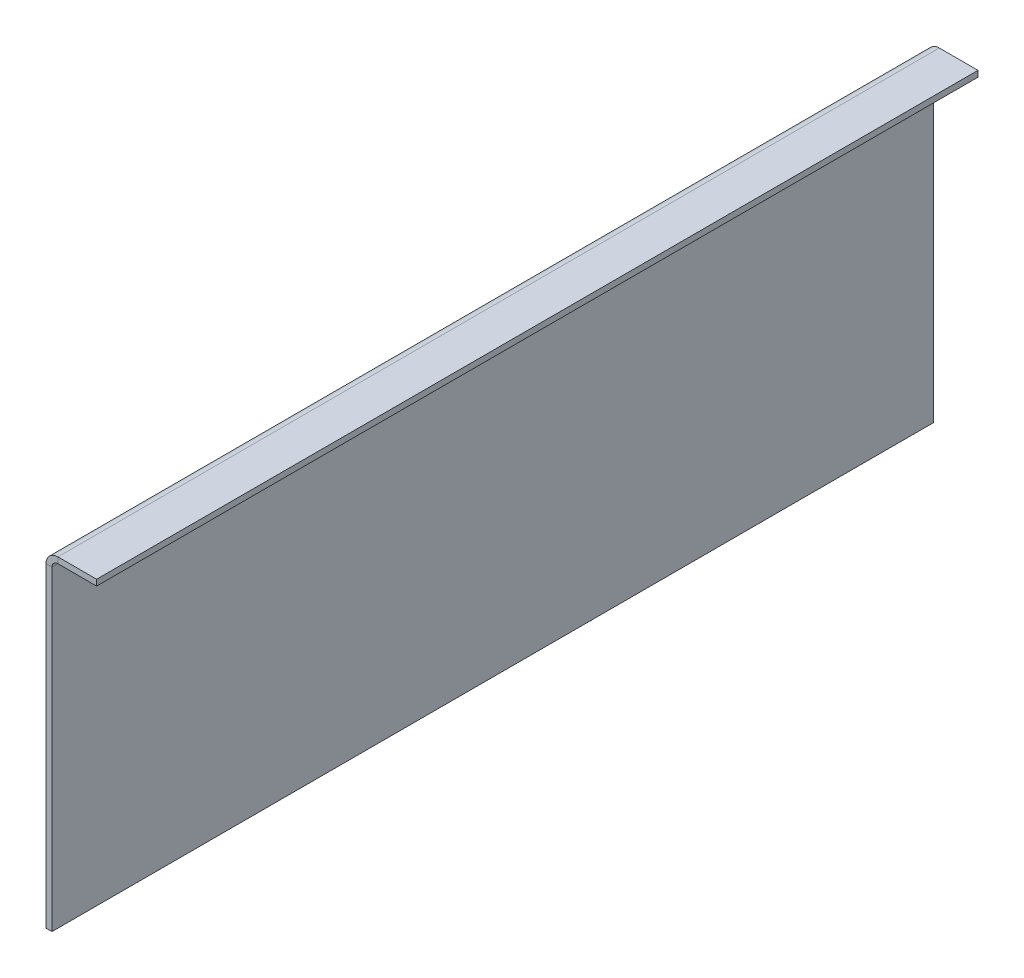
ISO-10303-21;
HEADER;
FILE_DESCRIPTION(('STEP AP214'),'2;1');
FILE_NAME('part.step','',(''),(''),'','','');
FILE_SCHEMA(('AUTOMOTIVE_DESIGN { 1 0 10303 214 1 1 1 1 }'));
ENDSEC;
DATA;
#1=APPLICATION_CONTEXT('core data for automotive mechanical design processes');
#2=APPLICATION_PROTOCOL_DEFINITION('international standard','automotive_design',2000,#1);
#3=PRODUCT_CONTEXT('',#1,'mechanical');
#4=PRODUCT('Part','Part','',(#3));
#5=PRODUCT_RELATED_PRODUCT_CATEGORY('part','',(#4));
#6=PRODUCT_DEFINITION_FORMATION('','',#4);
#7=PRODUCT_DEFINITION_CONTEXT('part definition',#1,'design');
#8=PRODUCT_DEFINITION('design','',#6,#7);
#9=PRODUCT_DEFINITION_SHAPE('','',#8);
#10=(LENGTH_UNIT() NAMED_UNIT(*) SI_UNIT(.MILLI.,.METRE.));
#11=(NAMED_UNIT(*) PLANE_ANGLE_UNIT() SI_UNIT($,.RADIAN.));
#12=(NAMED_UNIT(*) SI_UNIT($,.STERADIAN.) SOLID_ANGLE_UNIT());
#13=UNCERTAINTY_MEASURE_WITH_UNIT(LENGTH_MEASURE(1.E-05),#10,'distance_accuracy_value','');
#14=(GEOMETRIC_REPRESENTATION_CONTEXT(3) GLOBAL_UNCERTAINTY_ASSIGNED_CONTEXT((#13)) GLOBAL_UNIT_ASSIGNED_CONTEXT((#10,
#11,#12)) REPRESENTATION_CONTEXT('',''));
#15=CARTESIAN_POINT('',(0.,0.,0.));
#16=DIRECTION('',(0.,0.,1.));
#17=DIRECTION('',(1.,0.,0.));
#18=AXIS2_PLACEMENT_3D('',#15,#16,#17);
#19=CARTESIAN_POINT('',(17.,108.,-148.));
#20=DIRECTION('',(0.,0.,1.));
#21=DIRECTION('',(1.,0.,0.));
#22=AXIS2_PLACEMENT_3D('',#19,#20,#21);
#23=PLANE('',#22);
#24=DIRECTION('',(0.,-1.,0.));
#25=VECTOR('',#24,1.);
#26=CARTESIAN_POINT('',(3.99999999999999,108.,-148.));
#27=LINE('',#26,#25);
#28=CARTESIAN_POINT('',(3.99999999999999,110.,-148.));
#29=VERTEX_POINT('',#28);
#30=CARTESIAN_POINT('',(3.99999999999999,108.,-148.));
#31=VERTEX_POINT('',#30);
#32=EDGE_CURVE('E11',#29,#31,#27,.T.);
#33=ORIENTED_EDGE('',*,*,#32,.F.);
#34=DIRECTION('',(1.,0.,0.));
#35=VECTOR('',#34,1.);
#36=CARTESIAN_POINT('',(17.,110.,-148.));
#37=LINE('',#36,#35);
#38=CARTESIAN_POINT('',(17.,110.,-148.));
#39=VERTEX_POINT('',#38);
#40=EDGE_CURVE('E93',#29,#39,#37,.T.);
#41=ORIENTED_EDGE('',*,*,#40,.T.);
#42=DIRECTION('',(0.,-1.,0.));
#43=VECTOR('',#42,1.);
#44=CARTESIAN_POINT('',(17.,108.,-148.));
#45=LINE('',#44,#43);
#46=CARTESIAN_POINT('',(17.,108.,-148.));
#47=VERTEX_POINT('',#46);
#48=EDGE_CURVE('E53',#39,#47,#45,.T.);
#49=ORIENTED_EDGE('',*,*,#48,.T.);
#50=DIRECTION('',(1.,0.,0.));
#51=VECTOR('',#50,1.);
#52=CARTESIAN_POINT('',(17.,108.,-148.));
#53=LINE('',#52,#51);
#54=EDGE_CURVE('E96',#31,#47,#53,.T.);
#55=ORIENTED_EDGE('',*,*,#54,.F.);
#56=EDGE_LOOP('',(#33,#41,#49,#55));
#57=FACE_BOUND('',#56,.T.);
#58=ADVANCED_FACE('F43',(#57),#23,.F.);
#59=CARTESIAN_POINT('',(17.,108.,148.));
#60=DIRECTION('',(1.,0.,0.));
#61=DIRECTION('',(0.,0.,-1.));
#62=AXIS2_PLACEMENT_3D('',#59,#60,#61);
#63=PLANE('',#62);
#64=ORIENTED_EDGE('',*,*,#48,.F.);
#65=DIRECTION('',(0.,0.,1.));
#66=VECTOR('',#65,1.);
#67=CARTESIAN_POINT('',(17.,110.,148.));
#68=LINE('',#67,#66);
#69=CARTESIAN_POINT('',(17.,110.,148.));
#70=VERTEX_POINT('',#69);
#71=EDGE_CURVE('E121',#70,#39,#68,.F.);
#72=ORIENTED_EDGE('',*,*,#71,.F.);
#73=DIRECTION('',(0.,-1.,0.));
#74=VECTOR('',#73,1.);
#75=CARTESIAN_POINT('',(17.,108.,148.));
#76=LINE('',#75,#74);
#77=CARTESIAN_POINT('',(17.,108.,148.));
#78=VERTEX_POINT('',#77);
#79=EDGE_CURVE('E139',#70,#78,#76,.T.);
#80=ORIENTED_EDGE('',*,*,#79,.T.);
#81=DIRECTION('',(0.,0.,-1.));
#82=VECTOR('',#81,1.);
#83=CARTESIAN_POINT('',(17.,108.,148.));
#84=LINE('',#83,#82);
#85=EDGE_CURVE('E150',#78,#47,#84,.T.);
#86=ORIENTED_EDGE('',*,*,#85,.T.);
#87=EDGE_LOOP('',(#64,#72,#80,#86));
#88=FACE_BOUND('',#87,.T.);
#89=ADVANCED_FACE('F156',(#88),#63,.T.);
#90=CARTESIAN_POINT('',(17.,108.,148.));
#91=DIRECTION('',(0.,0.,1.));
#92=DIRECTION('',(1.,0.,0.));
#93=AXIS2_PLACEMENT_3D('',#90,#91,#92);
#94=PLANE('',#93);
#95=ORIENTED_EDGE('',*,*,#79,.F.);
#96=DIRECTION('',(1.,0.,0.));
#97=VECTOR('',#96,1.);
#98=CARTESIAN_POINT('',(17.,110.,148.));
#99=LINE('',#98,#97);
#100=CARTESIAN_POINT('',(3.99999999999999,110.,148.));
#101=VERTEX_POINT('',#100);
#102=EDGE_CURVE('E181',#101,#70,#99,.T.);
#103=ORIENTED_EDGE('',*,*,#102,.F.);
#104=DIRECTION('',(0.,-1.,0.));
#105=VECTOR('',#104,1.);
#106=CARTESIAN_POINT('',(3.99999999999999,108.,148.));
#107=LINE('',#106,#105);
#108=CARTESIAN_POINT('',(3.99999999999999,108.,148.));
#109=VERTEX_POINT('',#108);
#110=EDGE_CURVE('E136',#101,#109,#107,.T.);
#111=ORIENTED_EDGE('',*,*,#110,.T.);
#112=DIRECTION('',(1.,0.,0.));
#113=VECTOR('',#112,1.);
#114=CARTESIAN_POINT('',(17.,108.,148.));
#115=LINE('',#114,#113);
#116=EDGE_CURVE('E157',#109,#78,#115,.T.);
#117=ORIENTED_EDGE('',*,*,#116,.T.);
#118=EDGE_LOOP('',(#95,#103,#111,#117));
#119=FACE_BOUND('',#118,.T.);
#120=ADVANCED_FACE('F187',(#119),#94,.T.);
#121=CARTESIAN_POINT('',(3.99999999999999,106.,148.));
#122=DIRECTION('',(0.,0.,1.));
#123=DIRECTION('',(1.,0.,0.));
#124=AXIS2_PLACEMENT_3D('',#121,#122,#123);
#125=PLANE('',#124);
#126=ORIENTED_EDGE('',*,*,#110,.F.);
#127=CARTESIAN_POINT('',(3.99999999999999,106.,148.));
#128=DIRECTION('',(0.,0.,1.));
#129=DIRECTION('',(1.,0.,0.));
#130=AXIS2_PLACEMENT_3D('',#127,#128,#129);
#131=CIRCLE('',#130,4.);
#132=CARTESIAN_POINT('',(0.,106.,148.));
#133=VERTEX_POINT('',#132);
#134=EDGE_CURVE('E111',#101,#133,#131,.T.);
#135=ORIENTED_EDGE('',*,*,#134,.T.);
#136=DIRECTION('',(1.,0.,0.));
#137=VECTOR('',#136,1.);
#138=CARTESIAN_POINT('',(1.99999999999999,106.,148.));
#139=LINE('',#138,#137);
#140=CARTESIAN_POINT('',(1.99999999999999,106.,148.));
#141=VERTEX_POINT('',#140);
#142=EDGE_CURVE('E61',#133,#141,#139,.T.);
#143=ORIENTED_EDGE('',*,*,#142,.T.);
#144=CARTESIAN_POINT('',(3.99999999999999,106.,148.));
#145=DIRECTION('',(0.,0.,-1.));
#146=DIRECTION('',(-1.,0.,0.));
#147=AXIS2_PLACEMENT_3D('',#144,#145,#146);
#148=CIRCLE('',#147,2.);
#149=EDGE_CURVE('E154',#109,#141,#148,.F.);
#150=ORIENTED_EDGE('',*,*,#149,.F.);
#151=EDGE_LOOP('',(#126,#135,#143,#150));
#152=FACE_BOUND('',#151,.T.);
#153=ADVANCED_FACE('F190',(#152),#125,.T.);
#154=CARTESIAN_POINT('',(1.99999999999999,108.,148.));
#155=DIRECTION('',(0.,0.,1.));
#156=DIRECTION('',(0.,1.,0.));
#157=AXIS2_PLACEMENT_3D('',#154,#155,#156);
#158=PLANE('',#157);
#159=ORIENTED_EDGE('',*,*,#142,.F.);
#160=DIRECTION('',(0.,-1.,0.));
#161=VECTOR('',#160,1.);
#162=CARTESIAN_POINT('',(0.,108.,148.));
#163=LINE('',#162,#161);
#164=CARTESIAN_POINT('',(0.,0.,148.));
#165=VERTEX_POINT('',#164);
#166=EDGE_CURVE('E180',#165,#133,#163,.F.);
#167=ORIENTED_EDGE('',*,*,#166,.F.);
#168=DIRECTION('',(1.,0.,0.));
#169=VECTOR('',#168,1.);
#170=CARTESIAN_POINT('',(2.,0.,148.));
#171=LINE('',#170,#169);
#172=CARTESIAN_POINT('',(2.,0.,148.));
#173=VERTEX_POINT('',#172);
#174=EDGE_CURVE('E132',#165,#173,#171,.T.);
#175=ORIENTED_EDGE('',*,*,#174,.T.);
#176=DIRECTION('',(0.,1.,0.));
#177=VECTOR('',#176,1.);
#178=CARTESIAN_POINT('',(1.99999999999999,108.,148.));
#179=LINE('',#178,#177);
#180=EDGE_CURVE('E164',#173,#141,#179,.T.);
#181=ORIENTED_EDGE('',*,*,#180,.T.);
#182=EDGE_LOOP('',(#159,#167,#175,#181));
#183=FACE_BOUND('',#182,.T.);
#184=ADVANCED_FACE('F201',(#183),#158,.T.);
#185=CARTESIAN_POINT('',(2.,0.,148.));
#186=DIRECTION('',(0.,1.,0.));
#187=DIRECTION('',(0.,0.,-1.));
#188=AXIS2_PLACEMENT_3D('',#185,#186,#187);
#189=PLANE('',#188);
#190=ORIENTED_EDGE('',*,*,#174,.F.);
#191=DIRECTION('',(0.,0.,1.));
#192=VECTOR('',#191,1.);
#193=CARTESIAN_POINT('',(0.,0.,148.));
#194=LINE('',#193,#192);
#195=CARTESIAN_POINT('',(0.,0.,-148.));
#196=VERTEX_POINT('',#195);
#197=EDGE_CURVE('E116',#165,#196,#194,.F.);
#198=ORIENTED_EDGE('',*,*,#197,.T.);
#199=DIRECTION('',(1.,0.,0.));
#200=VECTOR('',#199,1.);
#201=CARTESIAN_POINT('',(2.,0.,-148.));
#202=LINE('',#201,#200);
#203=CARTESIAN_POINT('',(2.,0.,-148.));
#204=VERTEX_POINT('',#203);
#205=EDGE_CURVE('E129',#196,#204,#202,.T.);
#206=ORIENTED_EDGE('',*,*,#205,.T.);
#207=DIRECTION('',(0.,0.,-1.));
#208=VECTOR('',#207,1.);
#209=CARTESIAN_POINT('',(2.,0.,148.));
#210=LINE('',#209,#208);
#211=EDGE_CURVE('E167',#173,#204,#210,.T.);
#212=ORIENTED_EDGE('',*,*,#211,.F.);
#213=EDGE_LOOP('',(#190,#198,#206,#212));
#214=FACE_BOUND('',#213,.T.);
#215=ADVANCED_FACE('F207',(#214),#189,.F.);
#216=CARTESIAN_POINT('',(1.99999999999999,108.,-148.));
#217=DIRECTION('',(0.,0.,1.));
#218=DIRECTION('',(0.,1.,0.));
#219=AXIS2_PLACEMENT_3D('',#216,#217,#218);
#220=PLANE('',#219);
#221=ORIENTED_EDGE('',*,*,#205,.F.);
#222=DIRECTION('',(0.,-1.,0.));
#223=VECTOR('',#222,1.);
#224=CARTESIAN_POINT('',(0.,108.,-148.));
#225=LINE('',#224,#223);
#226=CARTESIAN_POINT('',(0.,106.,-148.));
#227=VERTEX_POINT('',#226);
#228=EDGE_CURVE('E178',#196,#227,#225,.F.);
#229=ORIENTED_EDGE('',*,*,#228,.T.);
#230=DIRECTION('',(1.,0.,0.));
#231=VECTOR('',#230,1.);
#232=CARTESIAN_POINT('',(1.99999999999999,106.,-148.));
#233=LINE('',#232,#231);
#234=CARTESIAN_POINT('',(1.99999999999999,106.,-148.));
#235=VERTEX_POINT('',#234);
#236=EDGE_CURVE('E47',#227,#235,#233,.T.);
#237=ORIENTED_EDGE('',*,*,#236,.T.);
#238=DIRECTION('',(0.,1.,0.));
#239=VECTOR('',#238,1.);
#240=CARTESIAN_POINT('',(1.99999999999999,108.,-148.));
#241=LINE('',#240,#239);
#242=EDGE_CURVE('E159',#204,#235,#241,.T.);
#243=ORIENTED_EDGE('',*,*,#242,.F.);
#244=EDGE_LOOP('',(#221,#229,#237,#243));
#245=FACE_BOUND('',#244,.T.);
#246=ADVANCED_FACE('F211',(#245),#220,.F.);
#247=CARTESIAN_POINT('',(3.99999999999999,106.,-148.));
#248=DIRECTION('',(0.,0.,-1.));
#249=DIRECTION('',(-1.,0.,0.));
#250=AXIS2_PLACEMENT_3D('',#247,#248,#249);
#251=PLANE('',#250);
#252=CARTESIAN_POINT('',(3.99999999999999,106.,-148.));
#253=DIRECTION('',(0.,0.,1.));
#254=DIRECTION('',(1.,0.,0.));
#255=AXIS2_PLACEMENT_3D('',#252,#253,#254);
#256=CIRCLE('',#255,4.);
#257=EDGE_CURVE('E109',#227,#29,#256,.F.);
#258=ORIENTED_EDGE('',*,*,#257,.T.);
#259=ORIENTED_EDGE('',*,*,#32,.T.);
#260=CARTESIAN_POINT('',(3.99999999999999,106.,-148.));
#261=DIRECTION('',(0.,0.,1.));
#262=DIRECTION('',(1.,0.,0.));
#263=AXIS2_PLACEMENT_3D('',#260,#261,#262);
#264=CIRCLE('',#263,2.);
#265=EDGE_CURVE('E174',#235,#31,#264,.F.);
#266=ORIENTED_EDGE('',*,*,#265,.F.);
#267=ORIENTED_EDGE('',*,*,#236,.F.);
#268=EDGE_LOOP('',(#258,#259,#266,#267));
#269=FACE_BOUND('',#268,.T.);
#270=ADVANCED_FACE('F45',(#269),#251,.T.);
#271=CARTESIAN_POINT('',(1.99999999999999,108.,148.));
#272=DIRECTION('',(-1.,0.,0.));
#273=DIRECTION('',(0.,-1.,0.));
#274=AXIS2_PLACEMENT_3D('',#271,#272,#273);
#275=PLANE('',#274);
#276=ORIENTED_EDGE('',*,*,#242,.T.);
#277=DIRECTION('',(0.,0.,-1.));
#278=VECTOR('',#277,1.);
#279=CARTESIAN_POINT('',(1.99999999999999,106.,148.));
#280=LINE('',#279,#278);
#281=EDGE_CURVE('E171',#235,#141,#280,.F.);
#282=ORIENTED_EDGE('',*,*,#281,.T.);
#283=ORIENTED_EDGE('',*,*,#180,.F.);
#284=ORIENTED_EDGE('',*,*,#211,.T.);
#285=EDGE_LOOP('',(#276,#282,#283,#284));
#286=FACE_BOUND('',#285,.T.);
#287=ADVANCED_FACE('F206',(#286),#275,.F.);
#288=CARTESIAN_POINT('',(17.,108.,148.));
#289=DIRECTION('',(0.,1.,0.));
#290=DIRECTION('',(0.,0.,1.));
#291=AXIS2_PLACEMENT_3D('',#288,#289,#290);
#292=PLANE('',#291);
#293=ORIENTED_EDGE('',*,*,#116,.F.);
#294=DIRECTION('',(0.,0.,-1.));
#295=VECTOR('',#294,1.);
#296=CARTESIAN_POINT('',(3.99999999999999,108.,-148.));
#297=LINE('',#296,#295);
#298=EDGE_CURVE('E153',#109,#31,#297,.T.);
#299=ORIENTED_EDGE('',*,*,#298,.T.);
#300=ORIENTED_EDGE('',*,*,#54,.T.);
#301=ORIENTED_EDGE('',*,*,#85,.F.);
#302=EDGE_LOOP('',(#293,#299,#300,#301));
#303=FACE_BOUND('',#302,.T.);
#304=ADVANCED_FACE('F149',(#303),#292,.F.);
#305=CARTESIAN_POINT('',(3.99999999999999,106.,148.));
#306=DIRECTION('',(0.,0.,1.));
#307=DIRECTION('',(1.,0.,0.));
#308=AXIS2_PLACEMENT_3D('',#305,#306,#307);
#309=CYLINDRICAL_SURFACE('',#308,2.);
#310=ORIENTED_EDGE('',*,*,#149,.T.);
#311=ORIENTED_EDGE('',*,*,#281,.F.);
#312=ORIENTED_EDGE('',*,*,#265,.T.);
#313=ORIENTED_EDGE('',*,*,#298,.F.);
#314=EDGE_LOOP('',(#310,#311,#312,#313));
#315=FACE_BOUND('',#314,.T.);
#316=ADVANCED_FACE('F193',(#315),#309,.F.);
#317=CARTESIAN_POINT('',(0.,108.,148.));
#318=DIRECTION('',(-1.,0.,0.));
#319=DIRECTION('',(0.,-1.,0.));
#320=AXIS2_PLACEMENT_3D('',#317,#318,#319);
#321=PLANE('',#320);
#322=ORIENTED_EDGE('',*,*,#228,.F.);
#323=ORIENTED_EDGE('',*,*,#197,.F.);
#324=ORIENTED_EDGE('',*,*,#166,.T.);
#325=DIRECTION('',(0.,0.,1.));
#326=VECTOR('',#325,1.);
#327=CARTESIAN_POINT('',(0.,106.,148.));
#328=LINE('',#327,#326);
#329=EDGE_CURVE('E115',#227,#133,#328,.T.);
#330=ORIENTED_EDGE('',*,*,#329,.F.);
#331=EDGE_LOOP('',(#322,#323,#324,#330));
#332=FACE_BOUND('',#331,.T.);
#333=ADVANCED_FACE('F213',(#332),#321,.T.);
#334=CARTESIAN_POINT('',(17.,110.,148.));
#335=DIRECTION('',(0.,1.,0.));
#336=DIRECTION('',(0.,0.,1.));
#337=AXIS2_PLACEMENT_3D('',#334,#335,#336);
#338=PLANE('',#337);
#339=ORIENTED_EDGE('',*,*,#102,.T.);
#340=ORIENTED_EDGE('',*,*,#71,.T.);
#341=ORIENTED_EDGE('',*,*,#40,.F.);
#342=DIRECTION('',(0.,0.,1.));
#343=VECTOR('',#342,1.);
#344=CARTESIAN_POINT('',(3.99999999999999,110.,148.));
#345=LINE('',#344,#343);
#346=EDGE_CURVE('E106',#101,#29,#345,.F.);
#347=ORIENTED_EDGE('',*,*,#346,.F.);
#348=EDGE_LOOP('',(#339,#340,#341,#347));
#349=FACE_BOUND('',#348,.T.);
#350=ADVANCED_FACE('F119',(#349),#338,.T.);
#351=CARTESIAN_POINT('',(3.99999999999999,106.,148.));
#352=DIRECTION('',(0.,0.,1.));
#353=DIRECTION('',(1.,0.,0.));
#354=AXIS2_PLACEMENT_3D('',#351,#352,#353);
#355=CYLINDRICAL_SURFACE('',#354,4.);
#356=ORIENTED_EDGE('',*,*,#134,.F.);
#357=ORIENTED_EDGE('',*,*,#346,.T.);
#358=ORIENTED_EDGE('',*,*,#257,.F.);
#359=ORIENTED_EDGE('',*,*,#329,.T.);
#360=EDGE_LOOP('',(#356,#357,#358,#359));
#361=FACE_BOUND('',#360,.T.);
#362=ADVANCED_FACE('F107',(#361),#355,.T.);
#363=CLOSED_SHELL('',(#58,#89,#120,#153,#184,#215,#246,#270,#287,#304,#316,#333,#350,#362));
#364=MANIFOLD_SOLID_BREP('B2',#363);
#365=ADVANCED_BREP_SHAPE_REPRESENTATION('',(#18,#364),#14);
#366=SHAPE_DEFINITION_REPRESENTATION(#9,#365);
ENDSEC;
END-ISO-10303-21;
